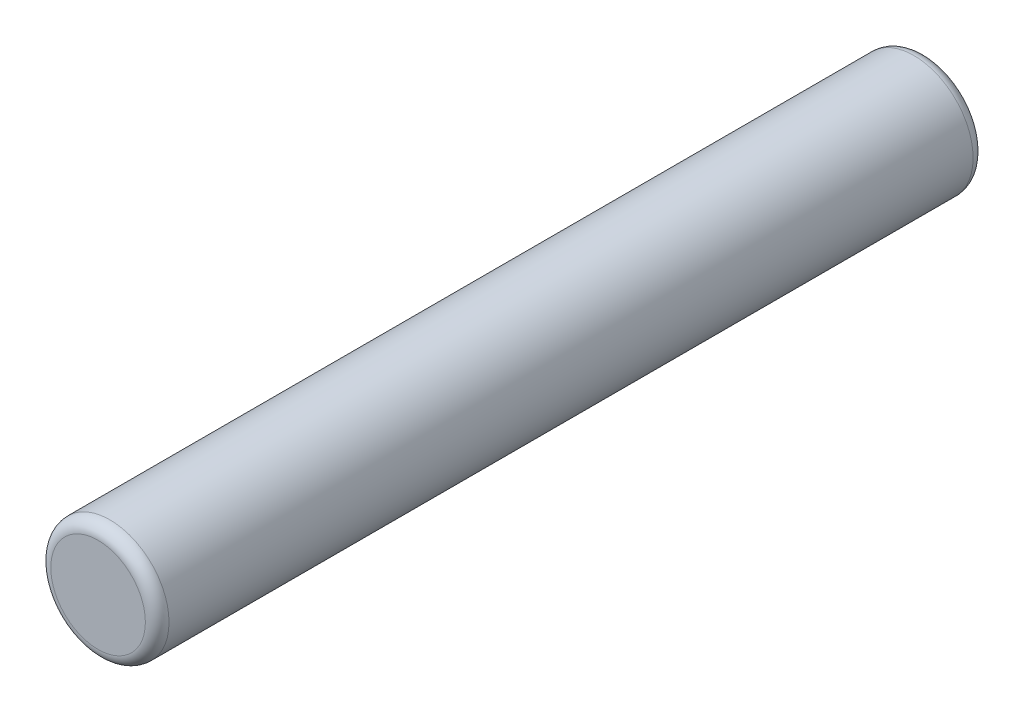
ISO-10303-21;
HEADER;
FILE_DESCRIPTION(('STEP AP214'),'2;1');
FILE_NAME('part.step','',(''),(''),'','','');
FILE_SCHEMA(('AUTOMOTIVE_DESIGN { 1 0 10303 214 1 1 1 1 }'));
ENDSEC;
DATA;
#1=APPLICATION_CONTEXT('core data for automotive mechanical design processes');
#2=APPLICATION_PROTOCOL_DEFINITION('international standard','automotive_design',2000,#1);
#3=PRODUCT_CONTEXT('',#1,'mechanical');
#4=PRODUCT('Part','Part','',(#3));
#5=PRODUCT_RELATED_PRODUCT_CATEGORY('part','',(#4));
#6=PRODUCT_DEFINITION_FORMATION('','',#4);
#7=PRODUCT_DEFINITION_CONTEXT('part definition',#1,'design');
#8=PRODUCT_DEFINITION('design','',#6,#7);
#9=PRODUCT_DEFINITION_SHAPE('','',#8);
#10=(LENGTH_UNIT() NAMED_UNIT(*) SI_UNIT(.MILLI.,.METRE.));
#11=(NAMED_UNIT(*) PLANE_ANGLE_UNIT() SI_UNIT($,.RADIAN.));
#12=(NAMED_UNIT(*) SI_UNIT($,.STERADIAN.) SOLID_ANGLE_UNIT());
#13=UNCERTAINTY_MEASURE_WITH_UNIT(LENGTH_MEASURE(1.E-05),#10,'distance_accuracy_value','');
#14=(GEOMETRIC_REPRESENTATION_CONTEXT(3) GLOBAL_UNCERTAINTY_ASSIGNED_CONTEXT((#13)) GLOBAL_UNIT_ASSIGNED_CONTEXT((#10,
#11,#12)) REPRESENTATION_CONTEXT('',''));
#15=CARTESIAN_POINT('',(0.,0.,0.));
#16=DIRECTION('',(0.,0.,1.));
#17=DIRECTION('',(1.,0.,0.));
#18=AXIS2_PLACEMENT_3D('',#15,#16,#17);
#19=CARTESIAN_POINT('',(0.,0.,35.));
#20=DIRECTION('',(0.,0.,-1.));
#21=DIRECTION('',(-1.,0.,0.));
#22=AXIS2_PLACEMENT_3D('',#19,#20,#21);
#23=CYLINDRICAL_SURFACE('',#22,5.);
#24=CARTESIAN_POINT('',(0.,0.,-34.));
#25=DIRECTION('',(0.,0.,1.));
#26=DIRECTION('',(1.,0.,0.));
#27=AXIS2_PLACEMENT_3D('',#24,#25,#26);
#28=CIRCLE('',#27,5.);
#29=CARTESIAN_POINT('',(5.,0.,-34.));
#30=VERTEX_POINT('',#29);
#31=EDGE_CURVE('E50',#30,#30,#28,.T.);
#32=ORIENTED_EDGE('',*,*,#31,.T.);
#33=EDGE_LOOP('',(#32));
#34=FACE_BOUND('',#33,.T.);
#35=CARTESIAN_POINT('',(0.,0.,34.));
#36=DIRECTION('',(0.,0.,1.));
#37=DIRECTION('',(1.,0.,0.));
#38=AXIS2_PLACEMENT_3D('',#35,#36,#37);
#39=CIRCLE('',#38,5.);
#40=CARTESIAN_POINT('',(5.,0.,34.));
#41=VERTEX_POINT('',#40);
#42=EDGE_CURVE('E55',#41,#41,#39,.F.);
#43=ORIENTED_EDGE('',*,*,#42,.T.);
#44=EDGE_LOOP('',(#43));
#45=FACE_BOUND('',#44,.T.);
#46=ADVANCED_FACE('F37',(#34,#45),#23,.T.);
#47=CARTESIAN_POINT('',(0.,0.,35.));
#48=DIRECTION('',(0.,0.,1.));
#49=DIRECTION('',(1.,0.,0.));
#50=AXIS2_PLACEMENT_3D('',#47,#48,#49);
#51=PLANE('',#50);
#52=CARTESIAN_POINT('',(0.,0.,35.));
#53=DIRECTION('',(0.,0.,1.));
#54=DIRECTION('',(1.,0.,0.));
#55=AXIS2_PLACEMENT_3D('',#52,#53,#54);
#56=CIRCLE('',#55,4.);
#57=CARTESIAN_POINT('',(4.,0.,35.));
#58=VERTEX_POINT('',#57);
#59=EDGE_CURVE('E10',#58,#58,#56,.T.);
#60=ORIENTED_EDGE('',*,*,#59,.T.);
#61=EDGE_LOOP('',(#60));
#62=FACE_BOUND('',#61,.T.);
#63=ADVANCED_FACE('F72',(#62),#51,.T.);
#64=CARTESIAN_POINT('',(0.,0.,-35.));
#65=DIRECTION('',(0.,0.,1.));
#66=DIRECTION('',(1.,0.,0.));
#67=AXIS2_PLACEMENT_3D('',#64,#65,#66);
#68=PLANE('',#67);
#69=CARTESIAN_POINT('',(0.,0.,-35.));
#70=DIRECTION('',(0.,0.,1.));
#71=DIRECTION('',(1.,0.,0.));
#72=AXIS2_PLACEMENT_3D('',#69,#70,#71);
#73=CIRCLE('',#72,4.);
#74=CARTESIAN_POINT('',(4.,0.,-35.));
#75=VERTEX_POINT('',#74);
#76=EDGE_CURVE('E45',#75,#75,#73,.F.);
#77=ORIENTED_EDGE('',*,*,#76,.T.);
#78=EDGE_LOOP('',(#77));
#79=FACE_BOUND('',#78,.T.);
#80=ADVANCED_FACE('F69',(#79),#68,.F.);
#81=CARTESIAN_POINT('',(0.,0.,-34.));
#82=DIRECTION('',(0.,0.,1.));
#83=DIRECTION('',(1.,0.,0.));
#84=AXIS2_PLACEMENT_3D('',#81,#82,#83);
#85=TOROIDAL_SURFACE('',#84,4.,1.);
#86=ORIENTED_EDGE('',*,*,#76,.F.);
#87=EDGE_LOOP('',(#86));
#88=FACE_BOUND('',#87,.T.);
#89=ORIENTED_EDGE('',*,*,#31,.F.);
#90=EDGE_LOOP('',(#89));
#91=FACE_BOUND('',#90,.T.);
#92=ADVANCED_FACE('F65',(#88,#91),#85,.T.);
#93=CARTESIAN_POINT('',(0.,0.,34.));
#94=DIRECTION('',(0.,0.,1.));
#95=DIRECTION('',(1.,0.,0.));
#96=AXIS2_PLACEMENT_3D('',#93,#94,#95);
#97=TOROIDAL_SURFACE('',#96,4.,1.);
#98=ORIENTED_EDGE('',*,*,#42,.F.);
#99=EDGE_LOOP('',(#98));
#100=FACE_BOUND('',#99,.T.);
#101=ORIENTED_EDGE('',*,*,#59,.F.);
#102=EDGE_LOOP('',(#101));
#103=FACE_BOUND('',#102,.T.);
#104=ADVANCED_FACE('F39',(#100,#103),#97,.T.);
#105=CLOSED_SHELL('',(#46,#63,#80,#92,#104));
#106=MANIFOLD_SOLID_BREP('B2',#105);
#107=ADVANCED_BREP_SHAPE_REPRESENTATION('',(#18,#106),#14);
#108=SHAPE_DEFINITION_REPRESENTATION(#9,#107);
ENDSEC;
END-ISO-10303-21;
